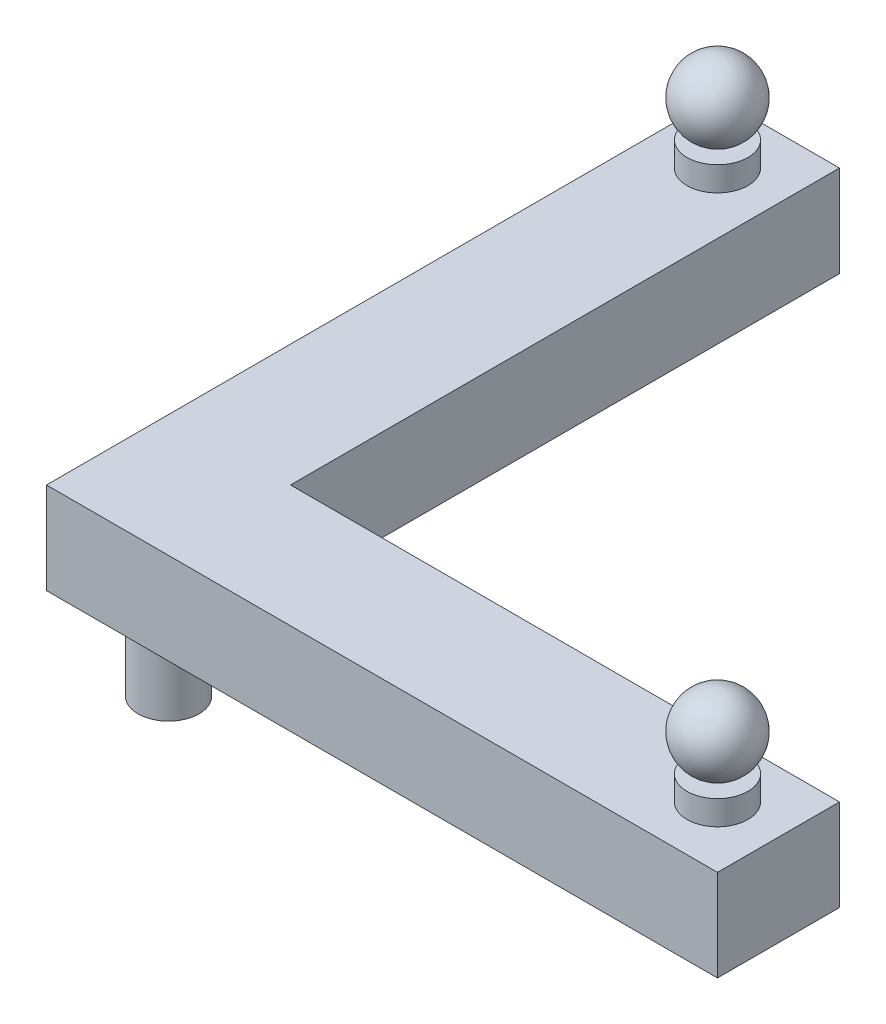
ISO-10303-21;
HEADER;
FILE_DESCRIPTION(('STEP AP214'),'2;1');
FILE_NAME('part.step','',(''),(''),'','','');
FILE_SCHEMA(('AUTOMOTIVE_DESIGN { 1 0 10303 214 1 1 1 1 }'));
ENDSEC;
DATA;
#1=APPLICATION_CONTEXT('core data for automotive mechanical design processes');
#2=APPLICATION_PROTOCOL_DEFINITION('international standard','automotive_design',2000,#1);
#3=PRODUCT_CONTEXT('',#1,'mechanical');
#4=PRODUCT('Part','Part','',(#3));
#5=PRODUCT_RELATED_PRODUCT_CATEGORY('part','',(#4));
#6=PRODUCT_DEFINITION_FORMATION('','',#4);
#7=PRODUCT_DEFINITION_CONTEXT('part definition',#1,'design');
#8=PRODUCT_DEFINITION('design','',#6,#7);
#9=PRODUCT_DEFINITION_SHAPE('','',#8);
#10=(LENGTH_UNIT() NAMED_UNIT(*) SI_UNIT(.MILLI.,.METRE.));
#11=(NAMED_UNIT(*) PLANE_ANGLE_UNIT() SI_UNIT($,.RADIAN.));
#12=(NAMED_UNIT(*) SI_UNIT($,.STERADIAN.) SOLID_ANGLE_UNIT());
#13=UNCERTAINTY_MEASURE_WITH_UNIT(LENGTH_MEASURE(1.E-05),#10,'distance_accuracy_value','');
#14=(GEOMETRIC_REPRESENTATION_CONTEXT(3) GLOBAL_UNCERTAINTY_ASSIGNED_CONTEXT((#13)) GLOBAL_UNIT_ASSIGNED_CONTEXT((#10,
#11,#12)) REPRESENTATION_CONTEXT('',''));
#15=CARTESIAN_POINT('',(0.,0.,0.));
#16=DIRECTION('',(0.,0.,1.));
#17=DIRECTION('',(1.,0.,0.));
#18=AXIS2_PLACEMENT_3D('',#15,#16,#17);
#19=CARTESIAN_POINT('',(127.,31.75,-12.7));
#20=DIRECTION('',(-1.,0.,0.));
#21=DIRECTION('',(0.,0.,-1.));
#22=AXIS2_PLACEMENT_3D('',#19,#20,#21);
#23=SPHERICAL_SURFACE('',#22,7.61999999999999);
#24=CARTESIAN_POINT('',(119.38,31.75,-12.7));
#25=VERTEX_POINT('',#24);
#26=VERTEX_LOOP('',#25);
#27=FACE_BOUND('',#26,.T.);
#28=ADVANCED_FACE('F36',(#27),#23,.T.);
#29=CLOSED_SHELL('',(#28));
#30=MANIFOLD_SOLID_BREP('B2',#29);
#31=CARTESIAN_POINT('',(12.7,31.75,-127.));
#32=DIRECTION('',(-1.,0.,0.));
#33=DIRECTION('',(0.,0.,-1.));
#34=AXIS2_PLACEMENT_3D('',#31,#32,#33);
#35=SPHERICAL_SURFACE('',#34,7.62);
#36=CARTESIAN_POINT('',(5.08000000000001,31.75,-127.));
#37=VERTEX_POINT('',#36);
#38=VERTEX_LOOP('',#37);
#39=FACE_BOUND('',#38,.T.);
#40=ADVANCED_FACE('F58',(#39),#35,.T.);
#41=CLOSED_SHELL('',(#40));
#42=MANIFOLD_SOLID_BREP('B6',#41);
#43=CARTESIAN_POINT('',(25.4,19.05,-139.7));
#44=DIRECTION('',(0.,0.,1.));
#45=DIRECTION('',(1.,0.,0.));
#46=AXIS2_PLACEMENT_3D('',#43,#44,#45);
#47=PLANE('',#46);
#48=DIRECTION('',(-1.,0.,0.));
#49=VECTOR('',#48,1.);
#50=CARTESIAN_POINT('',(25.4,0.,-139.7));
#51=LINE('',#50,#49);
#52=CARTESIAN_POINT('',(25.4,0.,-139.7));
#53=VERTEX_POINT('',#52);
#54=CARTESIAN_POINT('',(0.,0.,-139.7));
#55=VERTEX_POINT('',#54);
#56=EDGE_CURVE('E156',#53,#55,#51,.T.);
#57=ORIENTED_EDGE('',*,*,#56,.T.);
#58=DIRECTION('',(0.,-1.,0.));
#59=VECTOR('',#58,1.);
#60=CARTESIAN_POINT('',(0.,19.05,-139.7));
#61=LINE('',#60,#59);
#62=CARTESIAN_POINT('',(0.,19.05,-139.7));
#63=VERTEX_POINT('',#62);
#64=EDGE_CURVE('E79',#63,#55,#61,.T.);
#65=ORIENTED_EDGE('',*,*,#64,.F.);
#66=DIRECTION('',(-1.,0.,0.));
#67=VECTOR('',#66,1.);
#68=CARTESIAN_POINT('',(25.4,19.05,-139.7));
#69=LINE('',#68,#67);
#70=CARTESIAN_POINT('',(25.4,19.05,-139.7));
#71=VERTEX_POINT('',#70);
#72=EDGE_CURVE('E167',#71,#63,#69,.T.);
#73=ORIENTED_EDGE('',*,*,#72,.F.);
#74=DIRECTION('',(0.,-1.,0.));
#75=VECTOR('',#74,1.);
#76=CARTESIAN_POINT('',(25.4,19.05,-139.7));
#77=LINE('',#76,#75);
#78=EDGE_CURVE('E152',#71,#53,#77,.T.);
#79=ORIENTED_EDGE('',*,*,#78,.T.);
#80=EDGE_LOOP('',(#57,#65,#73,#79));
#81=FACE_BOUND('',#80,.T.);
#82=ADVANCED_FACE('F71',(#81),#47,.F.);
#83=CARTESIAN_POINT('',(0.,19.05,-139.7));
#84=DIRECTION('',(1.,0.,0.));
#85=DIRECTION('',(0.,0.,-1.));
#86=AXIS2_PLACEMENT_3D('',#83,#84,#85);
#87=PLANE('',#86);
#88=DIRECTION('',(0.,0.,1.));
#89=VECTOR('',#88,1.);
#90=CARTESIAN_POINT('',(0.,0.,-139.7));
#91=LINE('',#90,#89);
#92=CARTESIAN_POINT('',(0.,0.,0.));
#93=VERTEX_POINT('',#92);
#94=EDGE_CURVE('E159',#55,#93,#91,.T.);
#95=ORIENTED_EDGE('',*,*,#94,.T.);
#96=DIRECTION('',(0.,-1.,0.));
#97=VECTOR('',#96,1.);
#98=CARTESIAN_POINT('',(0.,19.05,0.));
#99=LINE('',#98,#97);
#100=CARTESIAN_POINT('',(0.,19.05,0.));
#101=VERTEX_POINT('',#100);
#102=EDGE_CURVE('E171',#101,#93,#99,.T.);
#103=ORIENTED_EDGE('',*,*,#102,.F.);
#104=DIRECTION('',(0.,0.,1.));
#105=VECTOR('',#104,1.);
#106=CARTESIAN_POINT('',(0.,19.05,-139.7));
#107=LINE('',#106,#105);
#108=EDGE_CURVE('E125',#63,#101,#107,.T.);
#109=ORIENTED_EDGE('',*,*,#108,.F.);
#110=ORIENTED_EDGE('',*,*,#64,.T.);
#111=EDGE_LOOP('',(#95,#103,#109,#110));
#112=FACE_BOUND('',#111,.T.);
#113=ADVANCED_FACE('F174',(#112),#87,.F.);
#114=CARTESIAN_POINT('',(0.,19.05,0.));
#115=DIRECTION('',(0.,0.,-1.));
#116=DIRECTION('',(-1.,0.,0.));
#117=AXIS2_PLACEMENT_3D('',#114,#115,#116);
#118=PLANE('',#117);
#119=DIRECTION('',(1.,0.,0.));
#120=VECTOR('',#119,1.);
#121=CARTESIAN_POINT('',(0.,0.,0.));
#122=LINE('',#121,#120);
#123=CARTESIAN_POINT('',(139.7,0.,0.));
#124=VERTEX_POINT('',#123);
#125=EDGE_CURVE('E162',#93,#124,#122,.T.);
#126=ORIENTED_EDGE('',*,*,#125,.T.);
#127=DIRECTION('',(0.,-1.,0.));
#128=VECTOR('',#127,1.);
#129=CARTESIAN_POINT('',(139.7,19.05,0.));
#130=LINE('',#129,#128);
#131=CARTESIAN_POINT('',(139.7,19.05,0.));
#132=VERTEX_POINT('',#131);
#133=EDGE_CURVE('E147',#132,#124,#130,.T.);
#134=ORIENTED_EDGE('',*,*,#133,.F.);
#135=DIRECTION('',(1.,0.,0.));
#136=VECTOR('',#135,1.);
#137=CARTESIAN_POINT('',(0.,19.05,0.));
#138=LINE('',#137,#136);
#139=EDGE_CURVE('E138',#101,#132,#138,.T.);
#140=ORIENTED_EDGE('',*,*,#139,.F.);
#141=ORIENTED_EDGE('',*,*,#102,.T.);
#142=EDGE_LOOP('',(#126,#134,#140,#141));
#143=FACE_BOUND('',#142,.T.);
#144=ADVANCED_FACE('F182',(#143),#118,.F.);
#145=CARTESIAN_POINT('',(139.7,19.05,0.));
#146=DIRECTION('',(-1.,0.,0.));
#147=DIRECTION('',(0.,0.,1.));
#148=AXIS2_PLACEMENT_3D('',#145,#146,#147);
#149=PLANE('',#148);
#150=DIRECTION('',(0.,0.,-1.));
#151=VECTOR('',#150,1.);
#152=CARTESIAN_POINT('',(139.7,0.,0.));
#153=LINE('',#152,#151);
#154=CARTESIAN_POINT('',(139.7,0.,-25.4));
#155=VERTEX_POINT('',#154);
#156=EDGE_CURVE('E146',#124,#155,#153,.T.);
#157=ORIENTED_EDGE('',*,*,#156,.T.);
#158=DIRECTION('',(0.,-1.,0.));
#159=VECTOR('',#158,1.);
#160=CARTESIAN_POINT('',(139.7,19.05,-25.4));
#161=LINE('',#160,#159);
#162=CARTESIAN_POINT('',(139.7,19.05,-25.4));
#163=VERTEX_POINT('',#162);
#164=EDGE_CURVE('E143',#163,#155,#161,.T.);
#165=ORIENTED_EDGE('',*,*,#164,.F.);
#166=DIRECTION('',(0.,0.,-1.));
#167=VECTOR('',#166,1.);
#168=CARTESIAN_POINT('',(139.7,19.05,0.));
#169=LINE('',#168,#167);
#170=EDGE_CURVE('E132',#132,#163,#169,.T.);
#171=ORIENTED_EDGE('',*,*,#170,.F.);
#172=ORIENTED_EDGE('',*,*,#133,.T.);
#173=EDGE_LOOP('',(#157,#165,#171,#172));
#174=FACE_BOUND('',#173,.T.);
#175=ADVANCED_FACE('F144',(#174),#149,.F.);
#176=CARTESIAN_POINT('',(139.7,19.05,-25.4));
#177=DIRECTION('',(0.,0.,1.));
#178=DIRECTION('',(1.,0.,0.));
#179=AXIS2_PLACEMENT_3D('',#176,#177,#178);
#180=PLANE('',#179);
#181=DIRECTION('',(-1.,0.,0.));
#182=VECTOR('',#181,1.);
#183=CARTESIAN_POINT('',(139.7,0.,-25.4));
#184=LINE('',#183,#182);
#185=CARTESIAN_POINT('',(25.4,0.,-25.4));
#186=VERTEX_POINT('',#185);
#187=EDGE_CURVE('E110',#155,#186,#184,.T.);
#188=ORIENTED_EDGE('',*,*,#187,.T.);
#189=DIRECTION('',(0.,-1.,0.));
#190=VECTOR('',#189,1.);
#191=CARTESIAN_POINT('',(25.4,19.05,-25.4));
#192=LINE('',#191,#190);
#193=CARTESIAN_POINT('',(25.4,19.05,-25.4));
#194=VERTEX_POINT('',#193);
#195=EDGE_CURVE('E148',#194,#186,#192,.T.);
#196=ORIENTED_EDGE('',*,*,#195,.F.);
#197=DIRECTION('',(-1.,0.,0.));
#198=VECTOR('',#197,1.);
#199=CARTESIAN_POINT('',(139.7,19.05,-25.4));
#200=LINE('',#199,#198);
#201=EDGE_CURVE('E136',#163,#194,#200,.T.);
#202=ORIENTED_EDGE('',*,*,#201,.F.);
#203=ORIENTED_EDGE('',*,*,#164,.T.);
#204=EDGE_LOOP('',(#188,#196,#202,#203));
#205=FACE_BOUND('',#204,.T.);
#206=ADVANCED_FACE('F150',(#205),#180,.F.);
#207=CARTESIAN_POINT('',(25.4,19.05,-25.4));
#208=DIRECTION('',(-1.,0.,0.));
#209=DIRECTION('',(0.,0.,1.));
#210=AXIS2_PLACEMENT_3D('',#207,#208,#209);
#211=PLANE('',#210);
#212=DIRECTION('',(0.,0.,-1.));
#213=VECTOR('',#212,1.);
#214=CARTESIAN_POINT('',(25.4,0.,-25.4));
#215=LINE('',#214,#213);
#216=EDGE_CURVE('E116',#186,#53,#215,.T.);
#217=ORIENTED_EDGE('',*,*,#216,.T.);
#218=ORIENTED_EDGE('',*,*,#78,.F.);
#219=DIRECTION('',(0.,0.,-1.));
#220=VECTOR('',#219,1.);
#221=CARTESIAN_POINT('',(25.4,19.05,-25.4));
#222=LINE('',#221,#220);
#223=EDGE_CURVE('E87',#194,#71,#222,.T.);
#224=ORIENTED_EDGE('',*,*,#223,.F.);
#225=ORIENTED_EDGE('',*,*,#195,.T.);
#226=EDGE_LOOP('',(#217,#218,#224,#225));
#227=FACE_BOUND('',#226,.T.);
#228=ADVANCED_FACE('F220',(#227),#211,.F.);
#229=CARTESIAN_POINT('',(0.,19.05,0.));
#230=DIRECTION('',(0.,1.,0.));
#231=DIRECTION('',(0.,0.,1.));
#232=AXIS2_PLACEMENT_3D('',#229,#230,#231);
#233=PLANE('',#232);
#234=CARTESIAN_POINT('',(12.7,19.05,-127.));
#235=DIRECTION('',(0.,1.,0.));
#236=DIRECTION('',(0.,0.,1.));
#237=AXIS2_PLACEMENT_3D('',#234,#235,#236);
#238=CIRCLE('',#237,6.35);
#239=CARTESIAN_POINT('',(12.7,19.05,-120.65));
#240=VERTEX_POINT('',#239);
#241=EDGE_CURVE('E192',#240,#240,#238,.T.);
#242=ORIENTED_EDGE('',*,*,#241,.F.);
#243=EDGE_LOOP('',(#242));
#244=FACE_BOUND('',#243,.T.);
#245=CARTESIAN_POINT('',(127.,19.05,-12.7));
#246=DIRECTION('',(0.,1.,0.));
#247=DIRECTION('',(0.,0.,1.));
#248=AXIS2_PLACEMENT_3D('',#245,#246,#247);
#249=CIRCLE('',#248,6.35);
#250=CARTESIAN_POINT('',(127.,19.05,-6.35));
#251=VERTEX_POINT('',#250);
#252=EDGE_CURVE('E186',#251,#251,#249,.T.);
#253=ORIENTED_EDGE('',*,*,#252,.F.);
#254=EDGE_LOOP('',(#253));
#255=FACE_BOUND('',#254,.T.);
#256=ORIENTED_EDGE('',*,*,#72,.T.);
#257=ORIENTED_EDGE('',*,*,#108,.T.);
#258=ORIENTED_EDGE('',*,*,#139,.T.);
#259=ORIENTED_EDGE('',*,*,#170,.T.);
#260=ORIENTED_EDGE('',*,*,#201,.T.);
#261=ORIENTED_EDGE('',*,*,#223,.T.);
#262=EDGE_LOOP('',(#256,#257,#258,#259,#260,#261));
#263=FACE_BOUND('',#262,.T.);
#264=ADVANCED_FACE('F134',(#244,#255,#263),#233,.T.);
#265=CARTESIAN_POINT('',(0.,0.,0.));
#266=DIRECTION('',(0.,1.,0.));
#267=DIRECTION('',(0.,0.,1.));
#268=AXIS2_PLACEMENT_3D('',#265,#266,#267);
#269=PLANE('',#268);
#270=CARTESIAN_POINT('',(12.7,0.,-12.7));
#271=DIRECTION('',(0.,1.,0.));
#272=DIRECTION('',(0.,0.,1.));
#273=AXIS2_PLACEMENT_3D('',#270,#271,#272);
#274=CIRCLE('',#273,6.35);
#275=CARTESIAN_POINT('',(12.7,0.,-6.35));
#276=VERTEX_POINT('',#275);
#277=EDGE_CURVE('E56',#276,#276,#274,.F.);
#278=ORIENTED_EDGE('',*,*,#277,.F.);
#279=EDGE_LOOP('',(#278));
#280=FACE_BOUND('',#279,.T.);
#281=ORIENTED_EDGE('',*,*,#56,.F.);
#282=ORIENTED_EDGE('',*,*,#216,.F.);
#283=ORIENTED_EDGE('',*,*,#187,.F.);
#284=ORIENTED_EDGE('',*,*,#156,.F.);
#285=ORIENTED_EDGE('',*,*,#125,.F.);
#286=ORIENTED_EDGE('',*,*,#94,.F.);
#287=EDGE_LOOP('',(#281,#282,#283,#284,#285,#286));
#288=FACE_BOUND('',#287,.T.);
#289=ADVANCED_FACE('F179',(#280,#288),#269,.F.);
#290=CARTESIAN_POINT('',(127.,24.13,-12.7));
#291=DIRECTION('',(0.,-1.,0.));
#292=DIRECTION('',(0.,0.,-1.));
#293=AXIS2_PLACEMENT_3D('',#290,#291,#292);
#294=CYLINDRICAL_SURFACE('',#293,6.35);
#295=CARTESIAN_POINT('',(127.,24.13,-12.7));
#296=DIRECTION('',(0.,1.,0.));
#297=DIRECTION('',(0.,0.,1.));
#298=AXIS2_PLACEMENT_3D('',#295,#296,#297);
#299=CIRCLE('',#298,6.35);
#300=CARTESIAN_POINT('',(127.,24.13,-6.35));
#301=VERTEX_POINT('',#300);
#302=EDGE_CURVE('E160',#301,#301,#299,.T.);
#303=ORIENTED_EDGE('',*,*,#302,.F.);
#304=EDGE_LOOP('',(#303));
#305=FACE_BOUND('',#304,.T.);
#306=ORIENTED_EDGE('',*,*,#252,.T.);
#307=EDGE_LOOP('',(#306));
#308=FACE_BOUND('',#307,.T.);
#309=ADVANCED_FACE('F211',(#305,#308),#294,.T.);
#310=CARTESIAN_POINT('',(127.,24.13,-12.7));
#311=DIRECTION('',(0.,1.,0.));
#312=DIRECTION('',(0.,0.,1.));
#313=AXIS2_PLACEMENT_3D('',#310,#311,#312);
#314=PLANE('',#313);
#315=ORIENTED_EDGE('',*,*,#302,.T.);
#316=EDGE_LOOP('',(#315));
#317=FACE_BOUND('',#316,.T.);
#318=ADVANCED_FACE('F217',(#317),#314,.T.);
#319=CARTESIAN_POINT('',(12.7,24.13,-127.));
#320=DIRECTION('',(0.,-1.,0.));
#321=DIRECTION('',(0.,0.,-1.));
#322=AXIS2_PLACEMENT_3D('',#319,#320,#321);
#323=CYLINDRICAL_SURFACE('',#322,6.35);
#324=CARTESIAN_POINT('',(12.7,24.13,-127.));
#325=DIRECTION('',(0.,1.,0.));
#326=DIRECTION('',(0.,0.,1.));
#327=AXIS2_PLACEMENT_3D('',#324,#325,#326);
#328=CIRCLE('',#327,6.35);
#329=CARTESIAN_POINT('',(12.7,24.13,-120.65));
#330=VERTEX_POINT('',#329);
#331=EDGE_CURVE('E189',#330,#330,#328,.T.);
#332=ORIENTED_EDGE('',*,*,#331,.F.);
#333=EDGE_LOOP('',(#332));
#334=FACE_BOUND('',#333,.T.);
#335=ORIENTED_EDGE('',*,*,#241,.T.);
#336=EDGE_LOOP('',(#335));
#337=FACE_BOUND('',#336,.T.);
#338=ADVANCED_FACE('F261',(#334,#337),#323,.T.);
#339=CARTESIAN_POINT('',(12.7,24.13,-127.));
#340=DIRECTION('',(0.,1.,0.));
#341=DIRECTION('',(0.,0.,1.));
#342=AXIS2_PLACEMENT_3D('',#339,#340,#341);
#343=PLANE('',#342);
#344=ORIENTED_EDGE('',*,*,#331,.T.);
#345=EDGE_LOOP('',(#344));
#346=FACE_BOUND('',#345,.T.);
#347=ADVANCED_FACE('F206',(#346),#343,.T.);
#348=CARTESIAN_POINT('',(12.7,-19.05,-12.7));
#349=DIRECTION('',(0.,1.,0.));
#350=DIRECTION('',(0.,0.,1.));
#351=AXIS2_PLACEMENT_3D('',#348,#349,#350);
#352=CYLINDRICAL_SURFACE('',#351,6.35);
#353=CARTESIAN_POINT('',(12.7,-19.05,-12.7));
#354=DIRECTION('',(0.,-1.,0.));
#355=DIRECTION('',(0.,0.,-1.));
#356=AXIS2_PLACEMENT_3D('',#353,#354,#355);
#357=CIRCLE('',#356,6.35);
#358=CARTESIAN_POINT('',(12.7,-19.05,-19.05));
#359=VERTEX_POINT('',#358);
#360=EDGE_CURVE('E195',#359,#359,#357,.T.);
#361=ORIENTED_EDGE('',*,*,#360,.F.);
#362=EDGE_LOOP('',(#361));
#363=FACE_BOUND('',#362,.T.);
#364=ORIENTED_EDGE('',*,*,#277,.T.);
#365=EDGE_LOOP('',(#364));
#366=FACE_BOUND('',#365,.T.);
#367=ADVANCED_FACE('F203',(#363,#366),#352,.T.);
#368=CARTESIAN_POINT('',(12.7,-19.05,-12.7));
#369=DIRECTION('',(0.,-1.,0.));
#370=DIRECTION('',(0.,0.,-1.));
#371=AXIS2_PLACEMENT_3D('',#368,#369,#370);
#372=PLANE('',#371);
#373=ORIENTED_EDGE('',*,*,#360,.T.);
#374=EDGE_LOOP('',(#373));
#375=FACE_BOUND('',#374,.T.);
#376=ADVANCED_FACE('F201',(#375),#372,.T.);
#377=CLOSED_SHELL('',(#82,#113,#144,#175,#206,#228,#264,#289,#309,#318,#338,#347,#367,#376));
#378=MANIFOLD_SOLID_BREP('B32',#377);
#379=ADVANCED_BREP_SHAPE_REPRESENTATION('',(#18,#30,#42,#378),#14);
#380=SHAPE_DEFINITION_REPRESENTATION(#9,#379);
ENDSEC;
END-ISO-10303-21;
